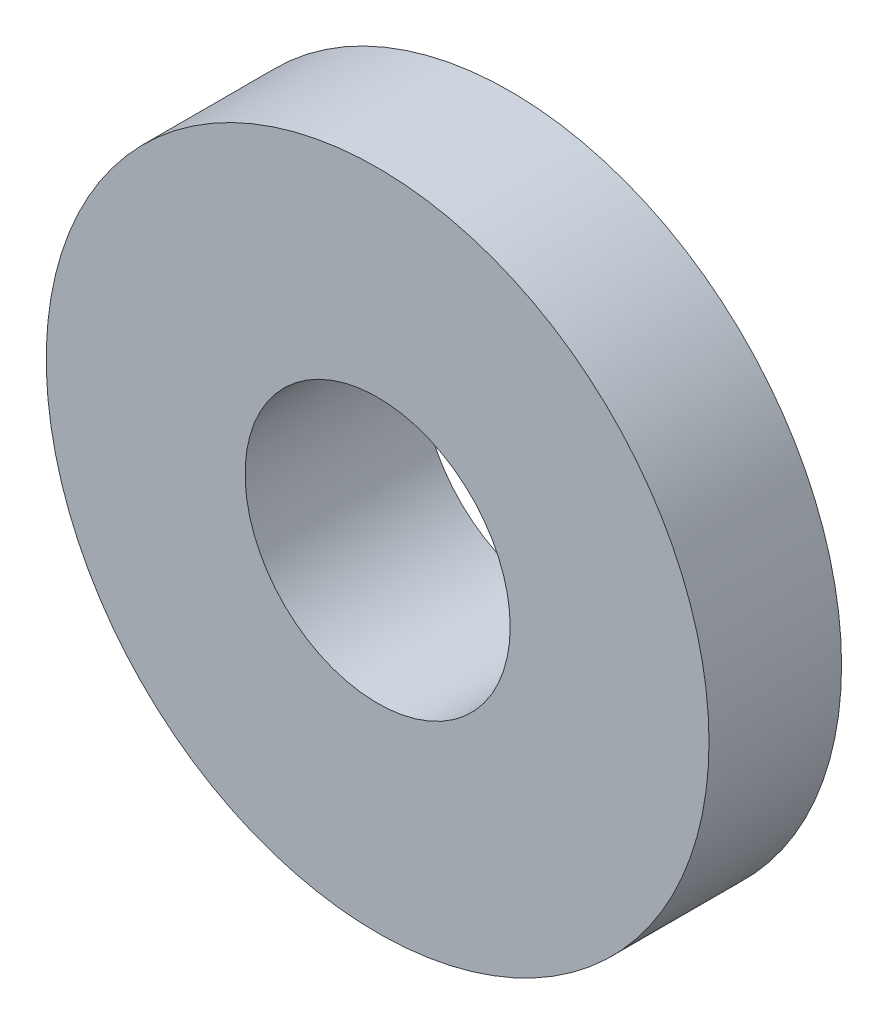
ISO-10303-21;
HEADER;
FILE_DESCRIPTION(('STEP AP214'),'2;1');
FILE_NAME('part.step','',(''),(''),'','','');
FILE_SCHEMA(('AUTOMOTIVE_DESIGN { 1 0 10303 214 1 1 1 1 }'));
ENDSEC;
DATA;
#1=APPLICATION_CONTEXT('core data for automotive mechanical design processes');
#2=APPLICATION_PROTOCOL_DEFINITION('international standard','automotive_design',2000,#1);
#3=PRODUCT_CONTEXT('',#1,'mechanical');
#4=PRODUCT('Part','Part','',(#3));
#5=PRODUCT_RELATED_PRODUCT_CATEGORY('part','',(#4));
#6=PRODUCT_DEFINITION_FORMATION('','',#4);
#7=PRODUCT_DEFINITION_CONTEXT('part definition',#1,'design');
#8=PRODUCT_DEFINITION('design','',#6,#7);
#9=PRODUCT_DEFINITION_SHAPE('','',#8);
#10=(LENGTH_UNIT() NAMED_UNIT(*) SI_UNIT(.MILLI.,.METRE.));
#11=(NAMED_UNIT(*) PLANE_ANGLE_UNIT() SI_UNIT($,.RADIAN.));
#12=(NAMED_UNIT(*) SI_UNIT($,.STERADIAN.) SOLID_ANGLE_UNIT());
#13=UNCERTAINTY_MEASURE_WITH_UNIT(LENGTH_MEASURE(1.E-05),#10,'distance_accuracy_value','');
#14=(GEOMETRIC_REPRESENTATION_CONTEXT(3) GLOBAL_UNCERTAINTY_ASSIGNED_CONTEXT((#13)) GLOBAL_UNIT_ASSIGNED_CONTEXT((#10,
#11,#12)) REPRESENTATION_CONTEXT('',''));
#15=CARTESIAN_POINT('',(0.,0.,0.));
#16=DIRECTION('',(0.,0.,1.));
#17=DIRECTION('',(1.,0.,0.));
#18=AXIS2_PLACEMENT_3D('',#15,#16,#17);
#19=CARTESIAN_POINT('',(0.,0.,3.));
#20=DIRECTION('',(0.,0.,-1.));
#21=DIRECTION('',(1.,0.,0.));
#22=AXIS2_PLACEMENT_3D('',#19,#20,#21);
#23=CYLINDRICAL_SURFACE('',#22,7.5);
#24=CARTESIAN_POINT('',(0.,0.,3.));
#25=DIRECTION('',(0.,0.,1.));
#26=DIRECTION('',(1.,0.,0.));
#27=AXIS2_PLACEMENT_3D('',#24,#25,#26);
#28=CIRCLE('',#27,7.5);
#29=CARTESIAN_POINT('',(7.5,0.,3.));
#30=VERTEX_POINT('',#29);
#31=EDGE_CURVE('E48',#30,#30,#28,.T.);
#32=ORIENTED_EDGE('',*,*,#31,.F.);
#33=EDGE_LOOP('',(#32));
#34=FACE_BOUND('',#33,.T.);
#35=CARTESIAN_POINT('',(0.,0.,0.));
#36=DIRECTION('',(0.,0.,1.));
#37=DIRECTION('',(1.,0.,0.));
#38=AXIS2_PLACEMENT_3D('',#35,#36,#37);
#39=CIRCLE('',#38,7.5);
#40=CARTESIAN_POINT('',(7.5,0.,0.));
#41=VERTEX_POINT('',#40);
#42=EDGE_CURVE('E44',#41,#41,#39,.T.);
#43=ORIENTED_EDGE('',*,*,#42,.T.);
#44=EDGE_LOOP('',(#43));
#45=FACE_BOUND('',#44,.T.);
#46=ADVANCED_FACE('F41',(#34,#45),#23,.T.);
#47=CARTESIAN_POINT('',(0.,0.,3.));
#48=DIRECTION('',(0.,0.,-1.));
#49=DIRECTION('',(1.,0.,0.));
#50=AXIS2_PLACEMENT_3D('',#47,#48,#49);
#51=CYLINDRICAL_SURFACE('',#50,3.);
#52=CARTESIAN_POINT('',(0.,0.,3.));
#53=DIRECTION('',(0.,0.,1.));
#54=DIRECTION('',(1.,0.,0.));
#55=AXIS2_PLACEMENT_3D('',#52,#53,#54);
#56=CIRCLE('',#55,3.);
#57=CARTESIAN_POINT('',(3.,0.,3.));
#58=VERTEX_POINT('',#57);
#59=EDGE_CURVE('E10',#58,#58,#56,.T.);
#60=ORIENTED_EDGE('',*,*,#59,.T.);
#61=EDGE_LOOP('',(#60));
#62=FACE_BOUND('',#61,.T.);
#63=CARTESIAN_POINT('',(0.,0.,-1.));
#64=DIRECTION('',(0.,0.,1.));
#65=DIRECTION('',(1.,0.,0.));
#66=AXIS2_PLACEMENT_3D('',#63,#64,#65);
#67=CIRCLE('',#66,3.);
#68=CARTESIAN_POINT('',(3.,0.,-1.));
#69=VERTEX_POINT('',#68);
#70=EDGE_CURVE('E57',#69,#69,#67,.T.);
#71=ORIENTED_EDGE('',*,*,#70,.F.);
#72=EDGE_LOOP('',(#71));
#73=FACE_BOUND('',#72,.T.);
#74=ADVANCED_FACE('F67',(#62,#73),#51,.F.);
#75=CARTESIAN_POINT('',(0.,0.,3.));
#76=DIRECTION('',(0.,0.,-1.));
#77=DIRECTION('',(1.,0.,0.));
#78=AXIS2_PLACEMENT_3D('',#75,#76,#77);
#79=PLANE('',#78);
#80=ORIENTED_EDGE('',*,*,#31,.T.);
#81=EDGE_LOOP('',(#80));
#82=FACE_BOUND('',#81,.T.);
#83=ORIENTED_EDGE('',*,*,#59,.F.);
#84=EDGE_LOOP('',(#83));
#85=FACE_BOUND('',#84,.T.);
#86=ADVANCED_FACE('F69',(#82,#85),#79,.F.);
#87=CARTESIAN_POINT('',(0.,0.,0.));
#88=DIRECTION('',(0.,0.,-1.));
#89=DIRECTION('',(1.,0.,0.));
#90=AXIS2_PLACEMENT_3D('',#87,#88,#89);
#91=PLANE('',#90);
#92=CARTESIAN_POINT('',(0.,0.,0.));
#93=DIRECTION('',(0.,0.,1.));
#94=DIRECTION('',(1.,0.,0.));
#95=AXIS2_PLACEMENT_3D('',#92,#93,#94);
#96=CIRCLE('',#95,5.);
#97=CARTESIAN_POINT('',(5.,0.,0.));
#98=VERTEX_POINT('',#97);
#99=EDGE_CURVE('E54',#98,#98,#96,.T.);
#100=ORIENTED_EDGE('',*,*,#99,.T.);
#101=EDGE_LOOP('',(#100));
#102=FACE_BOUND('',#101,.T.);
#103=ORIENTED_EDGE('',*,*,#42,.F.);
#104=EDGE_LOOP('',(#103));
#105=FACE_BOUND('',#104,.T.);
#106=ADVANCED_FACE('F74',(#102,#105),#91,.T.);
#107=CARTESIAN_POINT('',(0.,0.,-1.));
#108=DIRECTION('',(0.,0.,1.));
#109=DIRECTION('',(-1.,0.,0.));
#110=AXIS2_PLACEMENT_3D('',#107,#108,#109);
#111=CYLINDRICAL_SURFACE('',#110,5.);
#112=CARTESIAN_POINT('',(0.,0.,-1.));
#113=DIRECTION('',(0.,0.,1.));
#114=DIRECTION('',(1.,0.,0.));
#115=AXIS2_PLACEMENT_3D('',#112,#113,#114);
#116=CIRCLE('',#115,5.);
#117=CARTESIAN_POINT('',(5.,0.,-1.));
#118=VERTEX_POINT('',#117);
#119=EDGE_CURVE('E58',#118,#118,#116,.T.);
#120=ORIENTED_EDGE('',*,*,#119,.T.);
#121=EDGE_LOOP('',(#120));
#122=FACE_BOUND('',#121,.T.);
#123=ORIENTED_EDGE('',*,*,#99,.F.);
#124=EDGE_LOOP('',(#123));
#125=FACE_BOUND('',#124,.T.);
#126=ADVANCED_FACE('F80',(#122,#125),#111,.T.);
#127=CARTESIAN_POINT('',(0.,0.,-1.));
#128=DIRECTION('',(0.,0.,-1.));
#129=DIRECTION('',(1.,0.,0.));
#130=AXIS2_PLACEMENT_3D('',#127,#128,#129);
#131=PLANE('',#130);
#132=ORIENTED_EDGE('',*,*,#70,.T.);
#133=EDGE_LOOP('',(#132));
#134=FACE_BOUND('',#133,.T.);
#135=ORIENTED_EDGE('',*,*,#119,.F.);
#136=EDGE_LOOP('',(#135));
#137=FACE_BOUND('',#136,.T.);
#138=ADVANCED_FACE('F64',(#134,#137),#131,.T.);
#139=CLOSED_SHELL('',(#46,#74,#86,#106,#126,#138));
#140=MANIFOLD_SOLID_BREP('B2',#139);
#141=ADVANCED_BREP_SHAPE_REPRESENTATION('',(#18,#140),#14);
#142=SHAPE_DEFINITION_REPRESENTATION(#9,#141);
ENDSEC;
END-ISO-10303-21;
